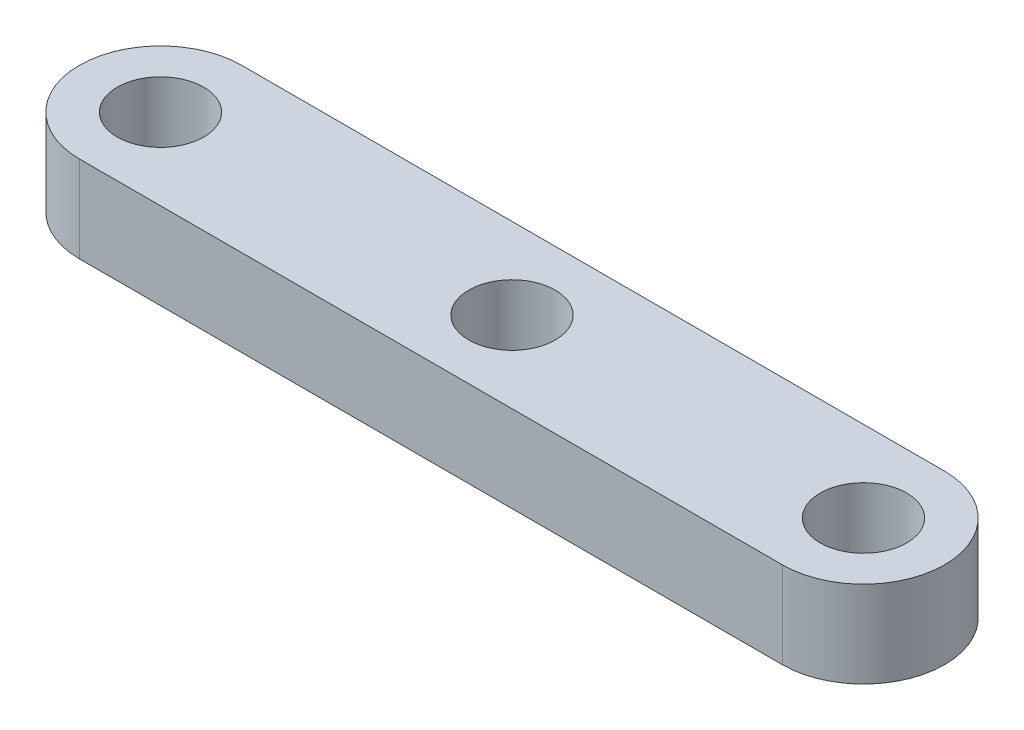
ISO-10303-21;
HEADER;
FILE_DESCRIPTION(('STEP AP214'),'2;1');
FILE_NAME('part.step','',(''),(''),'','','');
FILE_SCHEMA(('AUTOMOTIVE_DESIGN { 1 0 10303 214 1 1 1 1 }'));
ENDSEC;
DATA;
#1=APPLICATION_CONTEXT('core data for automotive mechanical design processes');
#2=APPLICATION_PROTOCOL_DEFINITION('international standard','automotive_design',2000,#1);
#3=PRODUCT_CONTEXT('',#1,'mechanical');
#4=PRODUCT('Part','Part','',(#3));
#5=PRODUCT_RELATED_PRODUCT_CATEGORY('part','',(#4));
#6=PRODUCT_DEFINITION_FORMATION('','',#4);
#7=PRODUCT_DEFINITION_CONTEXT('part definition',#1,'design');
#8=PRODUCT_DEFINITION('design','',#6,#7);
#9=PRODUCT_DEFINITION_SHAPE('','',#8);
#10=(LENGTH_UNIT() NAMED_UNIT(*) SI_UNIT(.MILLI.,.METRE.));
#11=(NAMED_UNIT(*) PLANE_ANGLE_UNIT() SI_UNIT($,.RADIAN.));
#12=(NAMED_UNIT(*) SI_UNIT($,.STERADIAN.) SOLID_ANGLE_UNIT());
#13=UNCERTAINTY_MEASURE_WITH_UNIT(LENGTH_MEASURE(1.E-05),#10,'distance_accuracy_value','');
#14=(GEOMETRIC_REPRESENTATION_CONTEXT(3) GLOBAL_UNCERTAINTY_ASSIGNED_CONTEXT((#13)) GLOBAL_UNIT_ASSIGNED_CONTEXT((#10,
#11,#12)) REPRESENTATION_CONTEXT('',''));
#15=CARTESIAN_POINT('',(0.,0.,0.));
#16=DIRECTION('',(0.,0.,1.));
#17=DIRECTION('',(1.,0.,0.));
#18=AXIS2_PLACEMENT_3D('',#15,#16,#17);
#19=CARTESIAN_POINT('',(0.,4.,0.));
#20=DIRECTION('',(0.,1.,0.));
#21=DIRECTION('',(0.,0.,1.));
#22=AXIS2_PLACEMENT_3D('',#19,#20,#21);
#23=PLANE('',#22);
#24=CARTESIAN_POINT('',(16.25,4.,0.));
#25=DIRECTION('',(0.,1.,0.));
#26=DIRECTION('',(0.,0.,1.));
#27=AXIS2_PLACEMENT_3D('',#24,#25,#26);
#28=CIRCLE('',#27,2.);
#29=CARTESIAN_POINT('',(16.25,4.,2.));
#30=VERTEX_POINT('',#29);
#31=EDGE_CURVE('E134',#30,#30,#28,.T.);
#32=ORIENTED_EDGE('',*,*,#31,.F.);
#33=EDGE_LOOP('',(#32));
#34=FACE_BOUND('',#33,.T.);
#35=CARTESIAN_POINT('',(0.,4.,0.));
#36=DIRECTION('',(0.,1.,0.));
#37=DIRECTION('',(0.,0.,1.));
#38=AXIS2_PLACEMENT_3D('',#35,#36,#37);
#39=CIRCLE('',#38,3.75);
#40=CARTESIAN_POINT('',(0.,4.,-3.75));
#41=VERTEX_POINT('',#40);
#42=CARTESIAN_POINT('',(0.,4.,3.75));
#43=VERTEX_POINT('',#42);
#44=EDGE_CURVE('E92',#41,#43,#39,.T.);
#45=ORIENTED_EDGE('',*,*,#44,.T.);
#46=DIRECTION('',(1.,0.,0.));
#47=VECTOR('',#46,1.);
#48=CARTESIAN_POINT('',(0.,4.,3.75));
#49=LINE('',#48,#47);
#50=CARTESIAN_POINT('',(32.5,4.,3.75));
#51=VERTEX_POINT('',#50);
#52=EDGE_CURVE('E87',#43,#51,#49,.T.);
#53=ORIENTED_EDGE('',*,*,#52,.T.);
#54=CARTESIAN_POINT('',(32.5,4.,0.));
#55=DIRECTION('',(0.,1.,0.));
#56=DIRECTION('',(0.,0.,1.));
#57=AXIS2_PLACEMENT_3D('',#54,#55,#56);
#58=CIRCLE('',#57,3.75);
#59=CARTESIAN_POINT('',(32.5,4.,-3.75));
#60=VERTEX_POINT('',#59);
#61=EDGE_CURVE('E90',#51,#60,#58,.T.);
#62=ORIENTED_EDGE('',*,*,#61,.T.);
#63=DIRECTION('',(-1.,0.,0.));
#64=VECTOR('',#63,1.);
#65=CARTESIAN_POINT('',(0.,4.,-3.75));
#66=LINE('',#65,#64);
#67=EDGE_CURVE('E57',#60,#41,#66,.T.);
#68=ORIENTED_EDGE('',*,*,#67,.T.);
#69=EDGE_LOOP('',(#45,#53,#62,#68));
#70=FACE_BOUND('',#69,.T.);
#71=CARTESIAN_POINT('',(0.,4.,0.));
#72=DIRECTION('',(0.,1.,0.));
#73=DIRECTION('',(0.,0.,1.));
#74=AXIS2_PLACEMENT_3D('',#71,#72,#73);
#75=CIRCLE('',#74,2.);
#76=CARTESIAN_POINT('',(0.,4.,2.));
#77=VERTEX_POINT('',#76);
#78=EDGE_CURVE('E112',#77,#77,#75,.T.);
#79=ORIENTED_EDGE('',*,*,#78,.F.);
#80=EDGE_LOOP('',(#79));
#81=FACE_BOUND('',#80,.T.);
#82=CARTESIAN_POINT('',(32.5,4.,0.));
#83=DIRECTION('',(0.,1.,0.));
#84=DIRECTION('',(0.,0.,1.));
#85=AXIS2_PLACEMENT_3D('',#82,#83,#84);
#86=CIRCLE('',#85,2.);
#87=CARTESIAN_POINT('',(32.5,4.,2.));
#88=VERTEX_POINT('',#87);
#89=EDGE_CURVE('E142',#88,#88,#86,.T.);
#90=ORIENTED_EDGE('',*,*,#89,.F.);
#91=EDGE_LOOP('',(#90));
#92=FACE_BOUND('',#91,.T.);
#93=ADVANCED_FACE('F39',(#34,#70,#81,#92),#23,.T.);
#94=CARTESIAN_POINT('',(0.,0.,0.));
#95=DIRECTION('',(0.,1.,0.));
#96=DIRECTION('',(0.,0.,1.));
#97=AXIS2_PLACEMENT_3D('',#94,#95,#96);
#98=PLANE('',#97);
#99=CARTESIAN_POINT('',(0.,0.,0.));
#100=DIRECTION('',(0.,1.,0.));
#101=DIRECTION('',(0.,0.,1.));
#102=AXIS2_PLACEMENT_3D('',#99,#100,#101);
#103=CIRCLE('',#102,3.75);
#104=CARTESIAN_POINT('',(0.,0.,-3.75));
#105=VERTEX_POINT('',#104);
#106=CARTESIAN_POINT('',(0.,0.,3.75));
#107=VERTEX_POINT('',#106);
#108=EDGE_CURVE('E108',#105,#107,#103,.T.);
#109=ORIENTED_EDGE('',*,*,#108,.F.);
#110=DIRECTION('',(-1.,0.,0.));
#111=VECTOR('',#110,1.);
#112=CARTESIAN_POINT('',(0.,0.,-3.75));
#113=LINE('',#112,#111);
#114=CARTESIAN_POINT('',(32.5,0.,-3.75));
#115=VERTEX_POINT('',#114);
#116=EDGE_CURVE('E80',#115,#105,#113,.T.);
#117=ORIENTED_EDGE('',*,*,#116,.F.);
#118=CARTESIAN_POINT('',(32.5,0.,0.));
#119=DIRECTION('',(0.,1.,0.));
#120=DIRECTION('',(0.,0.,1.));
#121=AXIS2_PLACEMENT_3D('',#118,#119,#120);
#122=CIRCLE('',#121,3.75);
#123=CARTESIAN_POINT('',(32.5,0.,3.75));
#124=VERTEX_POINT('',#123);
#125=EDGE_CURVE('E74',#124,#115,#122,.T.);
#126=ORIENTED_EDGE('',*,*,#125,.F.);
#127=DIRECTION('',(1.,0.,0.));
#128=VECTOR('',#127,1.);
#129=CARTESIAN_POINT('',(0.,0.,3.75));
#130=LINE('',#129,#128);
#131=EDGE_CURVE('E97',#107,#124,#130,.T.);
#132=ORIENTED_EDGE('',*,*,#131,.F.);
#133=EDGE_LOOP('',(#109,#117,#126,#132));
#134=FACE_BOUND('',#133,.T.);
#135=CARTESIAN_POINT('',(0.,0.,0.));
#136=DIRECTION('',(0.,1.,0.));
#137=DIRECTION('',(0.,0.,1.));
#138=AXIS2_PLACEMENT_3D('',#135,#136,#137);
#139=CIRCLE('',#138,2.);
#140=CARTESIAN_POINT('',(0.,0.,2.));
#141=VERTEX_POINT('',#140);
#142=EDGE_CURVE('E130',#141,#141,#139,.T.);
#143=ORIENTED_EDGE('',*,*,#142,.T.);
#144=EDGE_LOOP('',(#143));
#145=FACE_BOUND('',#144,.T.);
#146=CARTESIAN_POINT('',(16.25,0.,0.));
#147=DIRECTION('',(0.,1.,0.));
#148=DIRECTION('',(0.,0.,1.));
#149=AXIS2_PLACEMENT_3D('',#146,#147,#148);
#150=CIRCLE('',#149,2.);
#151=CARTESIAN_POINT('',(16.25,0.,2.));
#152=VERTEX_POINT('',#151);
#153=EDGE_CURVE('E138',#152,#152,#150,.T.);
#154=ORIENTED_EDGE('',*,*,#153,.T.);
#155=EDGE_LOOP('',(#154));
#156=FACE_BOUND('',#155,.T.);
#157=CARTESIAN_POINT('',(32.5,0.,0.));
#158=DIRECTION('',(0.,1.,0.));
#159=DIRECTION('',(0.,0.,1.));
#160=AXIS2_PLACEMENT_3D('',#157,#158,#159);
#161=CIRCLE('',#160,2.);
#162=CARTESIAN_POINT('',(32.5,0.,2.));
#163=VERTEX_POINT('',#162);
#164=EDGE_CURVE('E146',#163,#163,#161,.T.);
#165=ORIENTED_EDGE('',*,*,#164,.T.);
#166=EDGE_LOOP('',(#165));
#167=FACE_BOUND('',#166,.T.);
#168=ADVANCED_FACE('F125',(#134,#145,#156,#167),#98,.F.);
#169=CARTESIAN_POINT('',(0.,4.,0.));
#170=DIRECTION('',(0.,-1.,0.));
#171=DIRECTION('',(0.,0.,-1.));
#172=AXIS2_PLACEMENT_3D('',#169,#170,#171);
#173=CYLINDRICAL_SURFACE('',#172,3.75);
#174=ORIENTED_EDGE('',*,*,#108,.T.);
#175=DIRECTION('',(0.,-1.,0.));
#176=VECTOR('',#175,1.);
#177=CARTESIAN_POINT('',(0.,4.,3.75));
#178=LINE('',#177,#176);
#179=EDGE_CURVE('E11',#43,#107,#178,.T.);
#180=ORIENTED_EDGE('',*,*,#179,.F.);
#181=ORIENTED_EDGE('',*,*,#44,.F.);
#182=DIRECTION('',(0.,-1.,0.));
#183=VECTOR('',#182,1.);
#184=CARTESIAN_POINT('',(0.,4.,-3.75));
#185=LINE('',#184,#183);
#186=EDGE_CURVE('E104',#41,#105,#185,.T.);
#187=ORIENTED_EDGE('',*,*,#186,.T.);
#188=EDGE_LOOP('',(#174,#180,#181,#187));
#189=FACE_BOUND('',#188,.T.);
#190=ADVANCED_FACE('F41',(#189),#173,.T.);
#191=CARTESIAN_POINT('',(0.,4.,3.75));
#192=DIRECTION('',(0.,0.,-1.));
#193=DIRECTION('',(-1.,0.,0.));
#194=AXIS2_PLACEMENT_3D('',#191,#192,#193);
#195=PLANE('',#194);
#196=ORIENTED_EDGE('',*,*,#131,.T.);
#197=DIRECTION('',(0.,-1.,0.));
#198=VECTOR('',#197,1.);
#199=CARTESIAN_POINT('',(32.5,4.,3.75));
#200=LINE('',#199,#198);
#201=EDGE_CURVE('E49',#51,#124,#200,.T.);
#202=ORIENTED_EDGE('',*,*,#201,.F.);
#203=ORIENTED_EDGE('',*,*,#52,.F.);
#204=ORIENTED_EDGE('',*,*,#179,.T.);
#205=EDGE_LOOP('',(#196,#202,#203,#204));
#206=FACE_BOUND('',#205,.T.);
#207=ADVANCED_FACE('F96',(#206),#195,.F.);
#208=CARTESIAN_POINT('',(32.5,4.,0.));
#209=DIRECTION('',(0.,-1.,0.));
#210=DIRECTION('',(0.,0.,-1.));
#211=AXIS2_PLACEMENT_3D('',#208,#209,#210);
#212=CYLINDRICAL_SURFACE('',#211,3.75);
#213=ORIENTED_EDGE('',*,*,#125,.T.);
#214=DIRECTION('',(0.,-1.,0.));
#215=VECTOR('',#214,1.);
#216=CARTESIAN_POINT('',(32.5,4.,-3.75));
#217=LINE('',#216,#215);
#218=EDGE_CURVE('E99',#60,#115,#217,.T.);
#219=ORIENTED_EDGE('',*,*,#218,.F.);
#220=ORIENTED_EDGE('',*,*,#61,.F.);
#221=ORIENTED_EDGE('',*,*,#201,.T.);
#222=EDGE_LOOP('',(#213,#219,#220,#221));
#223=FACE_BOUND('',#222,.T.);
#224=ADVANCED_FACE('F100',(#223),#212,.T.);
#225=CARTESIAN_POINT('',(0.,4.,-3.75));
#226=DIRECTION('',(0.,0.,1.));
#227=DIRECTION('',(1.,0.,0.));
#228=AXIS2_PLACEMENT_3D('',#225,#226,#227);
#229=PLANE('',#228);
#230=ORIENTED_EDGE('',*,*,#116,.T.);
#231=ORIENTED_EDGE('',*,*,#186,.F.);
#232=ORIENTED_EDGE('',*,*,#67,.F.);
#233=ORIENTED_EDGE('',*,*,#218,.T.);
#234=EDGE_LOOP('',(#230,#231,#232,#233));
#235=FACE_BOUND('',#234,.T.);
#236=ADVANCED_FACE('F122',(#235),#229,.F.);
#237=CARTESIAN_POINT('',(0.,4.,0.));
#238=DIRECTION('',(0.,-1.,0.));
#239=DIRECTION('',(0.,0.,-1.));
#240=AXIS2_PLACEMENT_3D('',#237,#238,#239);
#241=CYLINDRICAL_SURFACE('',#240,2.);
#242=ORIENTED_EDGE('',*,*,#78,.T.);
#243=EDGE_LOOP('',(#242));
#244=FACE_BOUND('',#243,.T.);
#245=ORIENTED_EDGE('',*,*,#142,.F.);
#246=EDGE_LOOP('',(#245));
#247=FACE_BOUND('',#246,.T.);
#248=ADVANCED_FACE('F166',(#244,#247),#241,.F.);
#249=CARTESIAN_POINT('',(16.25,4.,0.));
#250=DIRECTION('',(0.,-1.,0.));
#251=DIRECTION('',(0.,0.,-1.));
#252=AXIS2_PLACEMENT_3D('',#249,#250,#251);
#253=CYLINDRICAL_SURFACE('',#252,2.);
#254=ORIENTED_EDGE('',*,*,#31,.T.);
#255=EDGE_LOOP('',(#254));
#256=FACE_BOUND('',#255,.T.);
#257=ORIENTED_EDGE('',*,*,#153,.F.);
#258=EDGE_LOOP('',(#257));
#259=FACE_BOUND('',#258,.T.);
#260=ADVANCED_FACE('F212',(#256,#259),#253,.F.);
#261=CARTESIAN_POINT('',(32.5,4.,0.));
#262=DIRECTION('',(0.,-1.,0.));
#263=DIRECTION('',(0.,0.,-1.));
#264=AXIS2_PLACEMENT_3D('',#261,#262,#263);
#265=CYLINDRICAL_SURFACE('',#264,2.);
#266=ORIENTED_EDGE('',*,*,#89,.T.);
#267=EDGE_LOOP('',(#266));
#268=FACE_BOUND('',#267,.T.);
#269=ORIENTED_EDGE('',*,*,#164,.F.);
#270=EDGE_LOOP('',(#269));
#271=FACE_BOUND('',#270,.T.);
#272=ADVANCED_FACE('F154',(#268,#271),#265,.F.);
#273=CLOSED_SHELL('',(#93,#168,#190,#207,#224,#236,#248,#260,#272));
#274=MANIFOLD_SOLID_BREP('B2',#273);
#275=ADVANCED_BREP_SHAPE_REPRESENTATION('',(#18,#274),#14);
#276=SHAPE_DEFINITION_REPRESENTATION(#9,#275);
ENDSEC;
END-ISO-10303-21;
